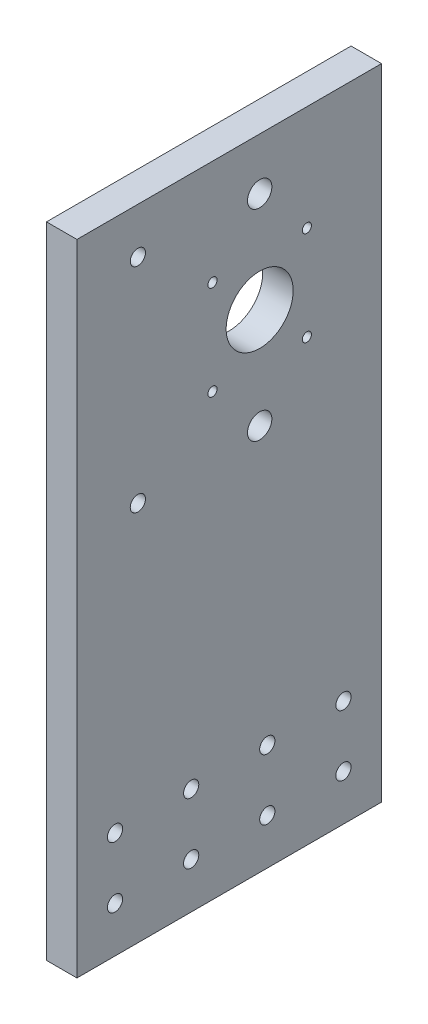
ISO-10303-21;
HEADER;
FILE_DESCRIPTION(('STEP AP214'),'2;1');
FILE_NAME('part.step','',(''),(''),'','','');
FILE_SCHEMA(('AUTOMOTIVE_DESIGN { 1 0 10303 214 1 1 1 1 }'));
ENDSEC;
DATA;
#1=APPLICATION_CONTEXT('core data for automotive mechanical design processes');
#2=APPLICATION_PROTOCOL_DEFINITION('international standard','automotive_design',2000,#1);
#3=PRODUCT_CONTEXT('',#1,'mechanical');
#4=PRODUCT('Part','Part','',(#3));
#5=PRODUCT_RELATED_PRODUCT_CATEGORY('part','',(#4));
#6=PRODUCT_DEFINITION_FORMATION('','',#4);
#7=PRODUCT_DEFINITION_CONTEXT('part definition',#1,'design');
#8=PRODUCT_DEFINITION('design','',#6,#7);
#9=PRODUCT_DEFINITION_SHAPE('','',#8);
#10=(LENGTH_UNIT() NAMED_UNIT(*) SI_UNIT(.MILLI.,.METRE.));
#11=(NAMED_UNIT(*) PLANE_ANGLE_UNIT() SI_UNIT($,.RADIAN.));
#12=(NAMED_UNIT(*) SI_UNIT($,.STERADIAN.) SOLID_ANGLE_UNIT());
#13=UNCERTAINTY_MEASURE_WITH_UNIT(LENGTH_MEASURE(1.E-05),#10,'distance_accuracy_value','');
#14=(GEOMETRIC_REPRESENTATION_CONTEXT(3) GLOBAL_UNCERTAINTY_ASSIGNED_CONTEXT((#13)) GLOBAL_UNIT_ASSIGNED_CONTEXT((#10,
#11,#12)) REPRESENTATION_CONTEXT('',''));
#15=CARTESIAN_POINT('',(0.,0.,0.));
#16=DIRECTION('',(0.,0.,1.));
#17=DIRECTION('',(1.,0.,0.));
#18=AXIS2_PLACEMENT_3D('',#15,#16,#17);
#19=CARTESIAN_POINT('',(0.,70.5,-15.5));
#20=DIRECTION('',(1.,0.,0.));
#21=DIRECTION('',(0.,0.,-1.));
#22=AXIS2_PLACEMENT_3D('',#19,#20,#21);
#23=CYLINDRICAL_SURFACE('',#22,1.5);
#24=CARTESIAN_POINT('',(10.,70.5,-15.5));
#25=DIRECTION('',(1.,0.,0.));
#26=DIRECTION('',(0.,0.,1.));
#27=AXIS2_PLACEMENT_3D('',#24,#25,#26);
#28=CIRCLE('',#27,1.5);
#29=CARTESIAN_POINT('',(10.,70.5,-14.));
#30=VERTEX_POINT('',#29);
#31=EDGE_CURVE('E131',#30,#30,#28,.T.);
#32=ORIENTED_EDGE('',*,*,#31,.T.);
#33=EDGE_LOOP('',(#32));
#34=FACE_BOUND('',#33,.T.);
#35=CARTESIAN_POINT('',(3.,70.5,-15.5));
#36=DIRECTION('',(-1.,0.,0.));
#37=DIRECTION('',(0.,0.,1.));
#38=AXIS2_PLACEMENT_3D('',#35,#36,#37);
#39=CIRCLE('',#38,1.5);
#40=CARTESIAN_POINT('',(3.,70.5,-14.));
#41=VERTEX_POINT('',#40);
#42=EDGE_CURVE('E117',#41,#41,#39,.F.);
#43=ORIENTED_EDGE('',*,*,#42,.F.);
#44=EDGE_LOOP('',(#43));
#45=FACE_BOUND('',#44,.T.);
#46=ADVANCED_FACE('F34',(#34,#45),#23,.F.);
#47=CARTESIAN_POINT('',(0.,39.5,15.5));
#48=DIRECTION('',(1.,0.,0.));
#49=DIRECTION('',(0.,0.,-1.));
#50=AXIS2_PLACEMENT_3D('',#47,#48,#49);
#51=CYLINDRICAL_SURFACE('',#50,1.5);
#52=CARTESIAN_POINT('',(10.,39.5,15.5));
#53=DIRECTION('',(1.,0.,0.));
#54=DIRECTION('',(0.,0.,1.));
#55=AXIS2_PLACEMENT_3D('',#52,#53,#54);
#56=CIRCLE('',#55,1.5);
#57=CARTESIAN_POINT('',(10.,39.5,17.));
#58=VERTEX_POINT('',#57);
#59=EDGE_CURVE('E126',#58,#58,#56,.T.);
#60=ORIENTED_EDGE('',*,*,#59,.T.);
#61=EDGE_LOOP('',(#60));
#62=FACE_BOUND('',#61,.T.);
#63=CARTESIAN_POINT('',(3.,39.5,15.5));
#64=DIRECTION('',(-1.,0.,0.));
#65=DIRECTION('',(0.,0.,1.));
#66=AXIS2_PLACEMENT_3D('',#63,#64,#65);
#67=CIRCLE('',#66,1.5);
#68=CARTESIAN_POINT('',(3.,39.5,17.));
#69=VERTEX_POINT('',#68);
#70=EDGE_CURVE('E114',#69,#69,#67,.F.);
#71=ORIENTED_EDGE('',*,*,#70,.F.);
#72=EDGE_LOOP('',(#71));
#73=FACE_BOUND('',#72,.T.);
#74=ADVANCED_FACE('F233',(#62,#73),#51,.F.);
#75=CARTESIAN_POINT('',(10.,0.,0.));
#76=DIRECTION('',(1.,0.,0.));
#77=DIRECTION('',(0.,0.,-1.));
#78=AXIS2_PLACEMENT_3D('',#75,#76,#77);
#79=PLANE('',#78);
#80=CARTESIAN_POINT('',(10.,39.4999999999999,-15.5));
#81=DIRECTION('',(1.,0.,0.));
#82=DIRECTION('',(0.,0.,-1.));
#83=AXIS2_PLACEMENT_3D('',#80,#81,#82);
#84=CIRCLE('',#83,1.5);
#85=CARTESIAN_POINT('',(10.,39.4999999999999,-17.));
#86=VERTEX_POINT('',#85);
#87=EDGE_CURVE('E122',#86,#86,#84,.T.);
#88=ORIENTED_EDGE('',*,*,#87,.F.);
#89=EDGE_LOOP('',(#88));
#90=FACE_BOUND('',#89,.T.);
#91=ORIENTED_EDGE('',*,*,#59,.F.);
#92=EDGE_LOOP('',(#91));
#93=FACE_BOUND('',#92,.T.);
#94=ORIENTED_EDGE('',*,*,#31,.F.);
#95=EDGE_LOOP('',(#94));
#96=FACE_BOUND('',#95,.T.);
#97=CARTESIAN_POINT('',(10.,70.5,15.5));
#98=DIRECTION('',(1.,0.,0.));
#99=DIRECTION('',(0.,0.,-1.));
#100=AXIS2_PLACEMENT_3D('',#97,#98,#99);
#101=CIRCLE('',#100,1.5);
#102=CARTESIAN_POINT('',(10.,70.5,14.));
#103=VERTEX_POINT('',#102);
#104=EDGE_CURVE('E142',#103,#103,#101,.T.);
#105=ORIENTED_EDGE('',*,*,#104,.F.);
#106=EDGE_LOOP('',(#105));
#107=FACE_BOUND('',#106,.T.);
#108=CARTESIAN_POINT('',(10.,55.,0.));
#109=DIRECTION('',(1.,0.,0.));
#110=DIRECTION('',(0.,0.,-1.));
#111=AXIS2_PLACEMENT_3D('',#108,#109,#110);
#112=CIRCLE('',#111,11.);
#113=CARTESIAN_POINT('',(10.,55.,-11.));
#114=VERTEX_POINT('',#113);
#115=EDGE_CURVE('E139',#114,#114,#112,.T.);
#116=ORIENTED_EDGE('',*,*,#115,.F.);
#117=EDGE_LOOP('',(#116));
#118=FACE_BOUND('',#117,.T.);
#119=CARTESIAN_POINT('',(10.,90.,40.));
#120=DIRECTION('',(1.,0.,0.));
#121=DIRECTION('',(0.,0.,-1.));
#122=AXIS2_PLACEMENT_3D('',#119,#120,#121);
#123=CIRCLE('',#122,2.5);
#124=CARTESIAN_POINT('',(10.,90.,37.5));
#125=VERTEX_POINT('',#124);
#126=EDGE_CURVE('E147',#125,#125,#123,.T.);
#127=ORIENTED_EDGE('',*,*,#126,.F.);
#128=EDGE_LOOP('',(#127));
#129=FACE_BOUND('',#128,.T.);
#130=CARTESIAN_POINT('',(10.,19.9999999999999,40.));
#131=DIRECTION('',(1.,0.,0.));
#132=DIRECTION('',(0.,0.,1.));
#133=AXIS2_PLACEMENT_3D('',#130,#131,#132);
#134=CIRCLE('',#133,2.5);
#135=CARTESIAN_POINT('',(10.,19.9999999999999,42.5));
#136=VERTEX_POINT('',#135);
#137=EDGE_CURVE('E138',#136,#136,#134,.T.);
#138=ORIENTED_EDGE('',*,*,#137,.F.);
#139=EDGE_LOOP('',(#138));
#140=FACE_BOUND('',#139,.T.);
#141=CARTESIAN_POINT('',(10.,-70.,47.5));
#142=DIRECTION('',(1.,0.,0.));
#143=DIRECTION('',(0.,0.,1.));
#144=AXIS2_PLACEMENT_3D('',#141,#142,#143);
#145=CIRCLE('',#144,2.5);
#146=CARTESIAN_POINT('',(10.,-70.,50.));
#147=VERTEX_POINT('',#146);
#148=EDGE_CURVE('E177',#147,#147,#145,.T.);
#149=ORIENTED_EDGE('',*,*,#148,.F.);
#150=EDGE_LOOP('',(#149));
#151=FACE_BOUND('',#150,.T.);
#152=CARTESIAN_POINT('',(10.,-90.,47.5));
#153=DIRECTION('',(1.,0.,0.));
#154=DIRECTION('',(0.,0.,-1.));
#155=AXIS2_PLACEMENT_3D('',#152,#153,#154);
#156=CIRCLE('',#155,2.5);
#157=CARTESIAN_POINT('',(10.,-90.,45.));
#158=VERTEX_POINT('',#157);
#159=EDGE_CURVE('E183',#158,#158,#156,.T.);
#160=ORIENTED_EDGE('',*,*,#159,.F.);
#161=EDGE_LOOP('',(#160));
#162=FACE_BOUND('',#161,.T.);
#163=CARTESIAN_POINT('',(10.,-90.,22.5));
#164=DIRECTION('',(1.,0.,0.));
#165=DIRECTION('',(0.,0.,1.));
#166=AXIS2_PLACEMENT_3D('',#163,#164,#165);
#167=CIRCLE('',#166,2.5);
#168=CARTESIAN_POINT('',(10.,-90.,25.));
#169=VERTEX_POINT('',#168);
#170=EDGE_CURVE('E189',#169,#169,#167,.T.);
#171=ORIENTED_EDGE('',*,*,#170,.F.);
#172=EDGE_LOOP('',(#171));
#173=FACE_BOUND('',#172,.T.);
#174=CARTESIAN_POINT('',(10.,-90.,-2.5));
#175=DIRECTION('',(1.,0.,0.));
#176=DIRECTION('',(0.,0.,-1.));
#177=AXIS2_PLACEMENT_3D('',#174,#175,#176);
#178=CIRCLE('',#177,2.5);
#179=CARTESIAN_POINT('',(10.,-90.,-4.99999999999999));
#180=VERTEX_POINT('',#179);
#181=EDGE_CURVE('E158',#180,#180,#178,.T.);
#182=ORIENTED_EDGE('',*,*,#181,.F.);
#183=EDGE_LOOP('',(#182));
#184=FACE_BOUND('',#183,.T.);
#185=CARTESIAN_POINT('',(10.,-90.,-27.5));
#186=DIRECTION('',(1.,0.,0.));
#187=DIRECTION('',(0.,0.,1.));
#188=AXIS2_PLACEMENT_3D('',#185,#186,#187);
#189=CIRCLE('',#188,2.5);
#190=CARTESIAN_POINT('',(10.,-90.,-25.));
#191=VERTEX_POINT('',#190);
#192=EDGE_CURVE('E159',#191,#191,#189,.T.);
#193=ORIENTED_EDGE('',*,*,#192,.F.);
#194=EDGE_LOOP('',(#193));
#195=FACE_BOUND('',#194,.T.);
#196=CARTESIAN_POINT('',(10.,-70.,-27.5));
#197=DIRECTION('',(1.,0.,0.));
#198=DIRECTION('',(0.,0.,-1.));
#199=AXIS2_PLACEMENT_3D('',#196,#197,#198);
#200=CIRCLE('',#199,2.5);
#201=CARTESIAN_POINT('',(10.,-70.,-30.));
#202=VERTEX_POINT('',#201);
#203=EDGE_CURVE('E165',#202,#202,#200,.T.);
#204=ORIENTED_EDGE('',*,*,#203,.F.);
#205=EDGE_LOOP('',(#204));
#206=FACE_BOUND('',#205,.T.);
#207=CARTESIAN_POINT('',(10.,-70.,-2.5));
#208=DIRECTION('',(1.,0.,0.));
#209=DIRECTION('',(0.,0.,1.));
#210=AXIS2_PLACEMENT_3D('',#207,#208,#209);
#211=CIRCLE('',#210,2.5);
#212=CARTESIAN_POINT('',(10.,-70.,0.));
#213=VERTEX_POINT('',#212);
#214=EDGE_CURVE('E146',#213,#213,#211,.T.);
#215=ORIENTED_EDGE('',*,*,#214,.F.);
#216=EDGE_LOOP('',(#215));
#217=FACE_BOUND('',#216,.T.);
#218=CARTESIAN_POINT('',(10.,-70.,22.5));
#219=DIRECTION('',(1.,0.,0.));
#220=DIRECTION('',(0.,0.,-1.));
#221=AXIS2_PLACEMENT_3D('',#218,#219,#220);
#222=CIRCLE('',#221,2.5);
#223=CARTESIAN_POINT('',(10.,-70.,20.));
#224=VERTEX_POINT('',#223);
#225=EDGE_CURVE('E176',#224,#224,#222,.T.);
#226=ORIENTED_EDGE('',*,*,#225,.F.);
#227=EDGE_LOOP('',(#226));
#228=FACE_BOUND('',#227,.T.);
#229=CARTESIAN_POINT('',(10.,88.,0.));
#230=DIRECTION('',(1.,0.,0.));
#231=DIRECTION('',(0.,0.,-1.));
#232=AXIS2_PLACEMENT_3D('',#229,#230,#231);
#233=CIRCLE('',#232,4.00000000000001);
#234=CARTESIAN_POINT('',(10.,88.,-4.00000000000001));
#235=VERTEX_POINT('',#234);
#236=EDGE_CURVE('E105',#235,#235,#233,.T.);
#237=ORIENTED_EDGE('',*,*,#236,.F.);
#238=EDGE_LOOP('',(#237));
#239=FACE_BOUND('',#238,.T.);
#240=DIRECTION('',(0.,-1.,0.));
#241=VECTOR('',#240,1.);
#242=CARTESIAN_POINT('',(10.,-105.,60.));
#243=LINE('',#242,#241);
#244=CARTESIAN_POINT('',(10.,105.,60.));
#245=VERTEX_POINT('',#244);
#246=CARTESIAN_POINT('',(10.,-105.,60.));
#247=VERTEX_POINT('',#246);
#248=EDGE_CURVE('E89',#245,#247,#243,.T.);
#249=ORIENTED_EDGE('',*,*,#248,.T.);
#250=DIRECTION('',(0.,0.,-1.));
#251=VECTOR('',#250,1.);
#252=CARTESIAN_POINT('',(10.,-105.,-40.));
#253=LINE('',#252,#251);
#254=CARTESIAN_POINT('',(10.,-105.,-40.));
#255=VERTEX_POINT('',#254);
#256=EDGE_CURVE('E83',#247,#255,#253,.T.);
#257=ORIENTED_EDGE('',*,*,#256,.T.);
#258=DIRECTION('',(0.,1.,0.));
#259=VECTOR('',#258,1.);
#260=CARTESIAN_POINT('',(10.,-105.,-40.));
#261=LINE('',#260,#259);
#262=CARTESIAN_POINT('',(10.,105.,-40.));
#263=VERTEX_POINT('',#262);
#264=EDGE_CURVE('E87',#255,#263,#261,.T.);
#265=ORIENTED_EDGE('',*,*,#264,.T.);
#266=DIRECTION('',(0.,0.,1.));
#267=VECTOR('',#266,1.);
#268=CARTESIAN_POINT('',(10.,105.,-40.));
#269=LINE('',#268,#267);
#270=EDGE_CURVE('E53',#263,#245,#269,.T.);
#271=ORIENTED_EDGE('',*,*,#270,.T.);
#272=EDGE_LOOP('',(#249,#257,#265,#271));
#273=FACE_BOUND('',#272,.T.);
#274=CARTESIAN_POINT('',(10.,22.,0.));
#275=DIRECTION('',(1.,0.,0.));
#276=DIRECTION('',(0.,0.,1.));
#277=AXIS2_PLACEMENT_3D('',#274,#275,#276);
#278=CIRCLE('',#277,4.);
#279=CARTESIAN_POINT('',(10.,22.,4.));
#280=VERTEX_POINT('',#279);
#281=EDGE_CURVE('E203',#280,#280,#278,.T.);
#282=ORIENTED_EDGE('',*,*,#281,.F.);
#283=EDGE_LOOP('',(#282));
#284=FACE_BOUND('',#283,.T.);
#285=ADVANCED_FACE('F84',(#90,#93,#96,#107,#118,#129,#140,#151,#162,#173,#184,#195,#206,#217,
#228,#239,#273,#284),#79,.T.);
#286=CARTESIAN_POINT('',(0.,0.,0.));
#287=DIRECTION('',(1.,0.,0.));
#288=DIRECTION('',(0.,0.,-1.));
#289=AXIS2_PLACEMENT_3D('',#286,#287,#288);
#290=PLANE('',#289);
#291=CARTESIAN_POINT('',(0.,39.4999999999999,-15.5));
#292=DIRECTION('',(-1.,0.,0.));
#293=DIRECTION('',(0.,0.,-1.));
#294=AXIS2_PLACEMENT_3D('',#291,#292,#293);
#295=CIRCLE('',#294,2.75);
#296=CARTESIAN_POINT('',(0.,39.4999999999999,-18.25));
#297=VERTEX_POINT('',#296);
#298=EDGE_CURVE('E447',#297,#297,#295,.T.);
#299=ORIENTED_EDGE('',*,*,#298,.F.);
#300=EDGE_LOOP('',(#299));
#301=FACE_BOUND('',#300,.T.);
#302=CARTESIAN_POINT('',(0.,39.4999999999999,15.5));
#303=DIRECTION('',(-1.,0.,0.));
#304=DIRECTION('',(0.,0.,1.));
#305=AXIS2_PLACEMENT_3D('',#302,#303,#304);
#306=CIRCLE('',#305,2.75);
#307=CARTESIAN_POINT('',(0.,39.4999999999999,18.25));
#308=VERTEX_POINT('',#307);
#309=EDGE_CURVE('E439',#308,#308,#306,.T.);
#310=ORIENTED_EDGE('',*,*,#309,.F.);
#311=EDGE_LOOP('',(#310));
#312=FACE_BOUND('',#311,.T.);
#313=CARTESIAN_POINT('',(0.,70.5,15.5));
#314=DIRECTION('',(-1.,0.,0.));
#315=DIRECTION('',(0.,0.,-1.));
#316=AXIS2_PLACEMENT_3D('',#313,#314,#315);
#317=CIRCLE('',#316,2.75);
#318=CARTESIAN_POINT('',(0.,70.5,12.75));
#319=VERTEX_POINT('',#318);
#320=EDGE_CURVE('E432',#319,#319,#317,.T.);
#321=ORIENTED_EDGE('',*,*,#320,.F.);
#322=EDGE_LOOP('',(#321));
#323=FACE_BOUND('',#322,.T.);
#324=CARTESIAN_POINT('',(0.,70.5,-15.5));
#325=DIRECTION('',(-1.,0.,0.));
#326=DIRECTION('',(0.,0.,1.));
#327=AXIS2_PLACEMENT_3D('',#324,#325,#326);
#328=CIRCLE('',#327,2.75);
#329=CARTESIAN_POINT('',(0.,70.5,-12.75));
#330=VERTEX_POINT('',#329);
#331=EDGE_CURVE('E436',#330,#330,#328,.T.);
#332=ORIENTED_EDGE('',*,*,#331,.F.);
#333=EDGE_LOOP('',(#332));
#334=FACE_BOUND('',#333,.T.);
#335=CARTESIAN_POINT('',(0.,55.,0.));
#336=DIRECTION('',(1.,0.,0.));
#337=DIRECTION('',(0.,0.,-1.));
#338=AXIS2_PLACEMENT_3D('',#335,#336,#337);
#339=CIRCLE('',#338,11.);
#340=CARTESIAN_POINT('',(0.,55.,-11.));
#341=VERTEX_POINT('',#340);
#342=EDGE_CURVE('E135',#341,#341,#339,.T.);
#343=ORIENTED_EDGE('',*,*,#342,.T.);
#344=EDGE_LOOP('',(#343));
#345=FACE_BOUND('',#344,.T.);
#346=CARTESIAN_POINT('',(0.,90.,40.));
#347=DIRECTION('',(1.,0.,0.));
#348=DIRECTION('',(0.,0.,-1.));
#349=AXIS2_PLACEMENT_3D('',#346,#347,#348);
#350=CIRCLE('',#349,2.5);
#351=CARTESIAN_POINT('',(0.,90.,37.5));
#352=VERTEX_POINT('',#351);
#353=EDGE_CURVE('E143',#352,#352,#350,.T.);
#354=ORIENTED_EDGE('',*,*,#353,.T.);
#355=EDGE_LOOP('',(#354));
#356=FACE_BOUND('',#355,.T.);
#357=CARTESIAN_POINT('',(0.,19.9999999999999,40.));
#358=DIRECTION('',(1.,0.,0.));
#359=DIRECTION('',(0.,0.,1.));
#360=AXIS2_PLACEMENT_3D('',#357,#358,#359);
#361=CIRCLE('',#360,2.5);
#362=CARTESIAN_POINT('',(0.,19.9999999999999,42.5));
#363=VERTEX_POINT('',#362);
#364=EDGE_CURVE('E150',#363,#363,#361,.T.);
#365=ORIENTED_EDGE('',*,*,#364,.T.);
#366=EDGE_LOOP('',(#365));
#367=FACE_BOUND('',#366,.T.);
#368=CARTESIAN_POINT('',(0.,-70.,47.5));
#369=DIRECTION('',(1.,0.,0.));
#370=DIRECTION('',(0.,0.,1.));
#371=AXIS2_PLACEMENT_3D('',#368,#369,#370);
#372=CIRCLE('',#371,2.5);
#373=CARTESIAN_POINT('',(0.,-70.,50.));
#374=VERTEX_POINT('',#373);
#375=EDGE_CURVE('E173',#374,#374,#372,.T.);
#376=ORIENTED_EDGE('',*,*,#375,.T.);
#377=EDGE_LOOP('',(#376));
#378=FACE_BOUND('',#377,.T.);
#379=CARTESIAN_POINT('',(0.,-90.,47.5));
#380=DIRECTION('',(1.,0.,0.));
#381=DIRECTION('',(0.,0.,-1.));
#382=AXIS2_PLACEMENT_3D('',#379,#380,#381);
#383=CIRCLE('',#382,2.5);
#384=CARTESIAN_POINT('',(0.,-90.,45.));
#385=VERTEX_POINT('',#384);
#386=EDGE_CURVE('E180',#385,#385,#383,.T.);
#387=ORIENTED_EDGE('',*,*,#386,.T.);
#388=EDGE_LOOP('',(#387));
#389=FACE_BOUND('',#388,.T.);
#390=CARTESIAN_POINT('',(0.,-90.,22.5));
#391=DIRECTION('',(1.,0.,0.));
#392=DIRECTION('',(0.,0.,1.));
#393=AXIS2_PLACEMENT_3D('',#390,#391,#392);
#394=CIRCLE('',#393,2.5);
#395=CARTESIAN_POINT('',(0.,-90.,25.));
#396=VERTEX_POINT('',#395);
#397=EDGE_CURVE('E186',#396,#396,#394,.T.);
#398=ORIENTED_EDGE('',*,*,#397,.T.);
#399=EDGE_LOOP('',(#398));
#400=FACE_BOUND('',#399,.T.);
#401=CARTESIAN_POINT('',(0.,-90.,-2.5));
#402=DIRECTION('',(1.,0.,0.));
#403=DIRECTION('',(0.,0.,-1.));
#404=AXIS2_PLACEMENT_3D('',#401,#402,#403);
#405=CIRCLE('',#404,2.5);
#406=CARTESIAN_POINT('',(0.,-90.,-4.99999999999999));
#407=VERTEX_POINT('',#406);
#408=EDGE_CURVE('E192',#407,#407,#405,.T.);
#409=ORIENTED_EDGE('',*,*,#408,.T.);
#410=EDGE_LOOP('',(#409));
#411=FACE_BOUND('',#410,.T.);
#412=CARTESIAN_POINT('',(0.,-90.,-27.5));
#413=DIRECTION('',(1.,0.,0.));
#414=DIRECTION('',(0.,0.,1.));
#415=AXIS2_PLACEMENT_3D('',#412,#413,#414);
#416=CIRCLE('',#415,2.5);
#417=CARTESIAN_POINT('',(0.,-90.,-25.));
#418=VERTEX_POINT('',#417);
#419=EDGE_CURVE('E155',#418,#418,#416,.T.);
#420=ORIENTED_EDGE('',*,*,#419,.T.);
#421=EDGE_LOOP('',(#420));
#422=FACE_BOUND('',#421,.T.);
#423=CARTESIAN_POINT('',(0.,-70.,-27.5));
#424=DIRECTION('',(1.,0.,0.));
#425=DIRECTION('',(0.,0.,-1.));
#426=AXIS2_PLACEMENT_3D('',#423,#424,#425);
#427=CIRCLE('',#426,2.5);
#428=CARTESIAN_POINT('',(0.,-70.,-30.));
#429=VERTEX_POINT('',#428);
#430=EDGE_CURVE('E162',#429,#429,#427,.T.);
#431=ORIENTED_EDGE('',*,*,#430,.T.);
#432=EDGE_LOOP('',(#431));
#433=FACE_BOUND('',#432,.T.);
#434=CARTESIAN_POINT('',(0.,-70.,-2.5));
#435=DIRECTION('',(1.,0.,0.));
#436=DIRECTION('',(0.,0.,1.));
#437=AXIS2_PLACEMENT_3D('',#434,#435,#436);
#438=CIRCLE('',#437,2.5);
#439=CARTESIAN_POINT('',(0.,-70.,0.));
#440=VERTEX_POINT('',#439);
#441=EDGE_CURVE('E168',#440,#440,#438,.T.);
#442=ORIENTED_EDGE('',*,*,#441,.T.);
#443=EDGE_LOOP('',(#442));
#444=FACE_BOUND('',#443,.T.);
#445=CARTESIAN_POINT('',(0.,-70.,22.5));
#446=DIRECTION('',(1.,0.,0.));
#447=DIRECTION('',(0.,0.,-1.));
#448=AXIS2_PLACEMENT_3D('',#445,#446,#447);
#449=CIRCLE('',#448,2.5);
#450=CARTESIAN_POINT('',(0.,-70.,20.));
#451=VERTEX_POINT('',#450);
#452=EDGE_CURVE('E197',#451,#451,#449,.T.);
#453=ORIENTED_EDGE('',*,*,#452,.T.);
#454=EDGE_LOOP('',(#453));
#455=FACE_BOUND('',#454,.T.);
#456=DIRECTION('',(0.,-1.,0.));
#457=VECTOR('',#456,1.);
#458=CARTESIAN_POINT('',(0.,-105.,60.));
#459=LINE('',#458,#457);
#460=CARTESIAN_POINT('',(0.,105.,60.));
#461=VERTEX_POINT('',#460);
#462=CARTESIAN_POINT('',(0.,-105.,60.));
#463=VERTEX_POINT('',#462);
#464=EDGE_CURVE('E102',#461,#463,#459,.T.);
#465=ORIENTED_EDGE('',*,*,#464,.F.);
#466=DIRECTION('',(0.,0.,1.));
#467=VECTOR('',#466,1.);
#468=CARTESIAN_POINT('',(0.,105.,-40.));
#469=LINE('',#468,#467);
#470=CARTESIAN_POINT('',(0.,105.,-40.));
#471=VERTEX_POINT('',#470);
#472=EDGE_CURVE('E76',#471,#461,#469,.T.);
#473=ORIENTED_EDGE('',*,*,#472,.F.);
#474=DIRECTION('',(0.,1.,0.));
#475=VECTOR('',#474,1.);
#476=CARTESIAN_POINT('',(0.,-105.,-40.));
#477=LINE('',#476,#475);
#478=CARTESIAN_POINT('',(0.,-105.,-40.));
#479=VERTEX_POINT('',#478);
#480=EDGE_CURVE('E70',#479,#471,#477,.T.);
#481=ORIENTED_EDGE('',*,*,#480,.F.);
#482=DIRECTION('',(0.,0.,-1.));
#483=VECTOR('',#482,1.);
#484=CARTESIAN_POINT('',(0.,-105.,-40.));
#485=LINE('',#484,#483);
#486=EDGE_CURVE('E93',#463,#479,#485,.T.);
#487=ORIENTED_EDGE('',*,*,#486,.F.);
#488=EDGE_LOOP('',(#465,#473,#481,#487));
#489=FACE_BOUND('',#488,.T.);
#490=CARTESIAN_POINT('',(0.,88.,0.));
#491=DIRECTION('',(1.,0.,0.));
#492=DIRECTION('',(0.,0.,-1.));
#493=AXIS2_PLACEMENT_3D('',#490,#491,#492);
#494=CIRCLE('',#493,4.00000000000001);
#495=CARTESIAN_POINT('',(0.,88.,-4.00000000000001));
#496=VERTEX_POINT('',#495);
#497=EDGE_CURVE('E206',#496,#496,#494,.T.);
#498=ORIENTED_EDGE('',*,*,#497,.T.);
#499=EDGE_LOOP('',(#498));
#500=FACE_BOUND('',#499,.T.);
#501=CARTESIAN_POINT('',(0.,22.,0.));
#502=DIRECTION('',(1.,0.,0.));
#503=DIRECTION('',(0.,0.,1.));
#504=AXIS2_PLACEMENT_3D('',#501,#502,#503);
#505=CIRCLE('',#504,4.);
#506=CARTESIAN_POINT('',(0.,22.,4.));
#507=VERTEX_POINT('',#506);
#508=EDGE_CURVE('E200',#507,#507,#505,.T.);
#509=ORIENTED_EDGE('',*,*,#508,.T.);
#510=EDGE_LOOP('',(#509));
#511=FACE_BOUND('',#510,.T.);
#512=ADVANCED_FACE('F214',(#301,#312,#323,#334,#345,#356,#367,#378,#389,#400,#411,#422,#433,
#444,#455,#489,#500,#511),#290,.F.);
#513=CARTESIAN_POINT('',(10.,-105.,60.));
#514=DIRECTION('',(0.,0.,-1.));
#515=DIRECTION('',(-1.,0.,0.));
#516=AXIS2_PLACEMENT_3D('',#513,#514,#515);
#517=PLANE('',#516);
#518=ORIENTED_EDGE('',*,*,#464,.T.);
#519=DIRECTION('',(-1.,0.,0.));
#520=VECTOR('',#519,1.);
#521=CARTESIAN_POINT('',(10.,-105.,60.));
#522=LINE('',#521,#520);
#523=EDGE_CURVE('E11',#247,#463,#522,.T.);
#524=ORIENTED_EDGE('',*,*,#523,.F.);
#525=ORIENTED_EDGE('',*,*,#248,.F.);
#526=DIRECTION('',(-1.,0.,0.));
#527=VECTOR('',#526,1.);
#528=CARTESIAN_POINT('',(10.,105.,60.));
#529=LINE('',#528,#527);
#530=EDGE_CURVE('E98',#245,#461,#529,.T.);
#531=ORIENTED_EDGE('',*,*,#530,.T.);
#532=EDGE_LOOP('',(#518,#524,#525,#531));
#533=FACE_BOUND('',#532,.T.);
#534=ADVANCED_FACE('F36',(#533),#517,.F.);
#535=CARTESIAN_POINT('',(10.,-105.,-40.));
#536=DIRECTION('',(0.,1.,0.));
#537=DIRECTION('',(0.,0.,1.));
#538=AXIS2_PLACEMENT_3D('',#535,#536,#537);
#539=PLANE('',#538);
#540=ORIENTED_EDGE('',*,*,#486,.T.);
#541=DIRECTION('',(-1.,0.,0.));
#542=VECTOR('',#541,1.);
#543=CARTESIAN_POINT('',(10.,-105.,-40.));
#544=LINE('',#543,#542);
#545=EDGE_CURVE('E44',#255,#479,#544,.T.);
#546=ORIENTED_EDGE('',*,*,#545,.F.);
#547=ORIENTED_EDGE('',*,*,#256,.F.);
#548=ORIENTED_EDGE('',*,*,#523,.T.);
#549=EDGE_LOOP('',(#540,#546,#547,#548));
#550=FACE_BOUND('',#549,.T.);
#551=ADVANCED_FACE('F92',(#550),#539,.F.);
#552=CARTESIAN_POINT('',(10.,-105.,-40.));
#553=DIRECTION('',(0.,0.,1.));
#554=DIRECTION('',(1.,0.,0.));
#555=AXIS2_PLACEMENT_3D('',#552,#553,#554);
#556=PLANE('',#555);
#557=ORIENTED_EDGE('',*,*,#480,.T.);
#558=DIRECTION('',(-1.,0.,0.));
#559=VECTOR('',#558,1.);
#560=CARTESIAN_POINT('',(10.,105.,-40.));
#561=LINE('',#560,#559);
#562=EDGE_CURVE('E94',#263,#471,#561,.T.);
#563=ORIENTED_EDGE('',*,*,#562,.F.);
#564=ORIENTED_EDGE('',*,*,#264,.F.);
#565=ORIENTED_EDGE('',*,*,#545,.T.);
#566=EDGE_LOOP('',(#557,#563,#564,#565));
#567=FACE_BOUND('',#566,.T.);
#568=ADVANCED_FACE('F96',(#567),#556,.F.);
#569=CARTESIAN_POINT('',(10.,105.,-40.));
#570=DIRECTION('',(0.,-1.,0.));
#571=DIRECTION('',(0.,0.,-1.));
#572=AXIS2_PLACEMENT_3D('',#569,#570,#571);
#573=PLANE('',#572);
#574=ORIENTED_EDGE('',*,*,#472,.T.);
#575=ORIENTED_EDGE('',*,*,#530,.F.);
#576=ORIENTED_EDGE('',*,*,#270,.F.);
#577=ORIENTED_EDGE('',*,*,#562,.T.);
#578=EDGE_LOOP('',(#574,#575,#576,#577));
#579=FACE_BOUND('',#578,.T.);
#580=ADVANCED_FACE('F220',(#579),#573,.F.);
#581=CARTESIAN_POINT('',(10.,88.,0.));
#582=DIRECTION('',(-1.,0.,0.));
#583=DIRECTION('',(0.,0.,1.));
#584=AXIS2_PLACEMENT_3D('',#581,#582,#583);
#585=CYLINDRICAL_SURFACE('',#584,4.00000000000001);
#586=ORIENTED_EDGE('',*,*,#236,.T.);
#587=EDGE_LOOP('',(#586));
#588=FACE_BOUND('',#587,.T.);
#589=ORIENTED_EDGE('',*,*,#497,.F.);
#590=EDGE_LOOP('',(#589));
#591=FACE_BOUND('',#590,.T.);
#592=ADVANCED_FACE('F217',(#588,#591),#585,.F.);
#593=CARTESIAN_POINT('',(10.,22.,0.));
#594=DIRECTION('',(-1.,0.,0.));
#595=DIRECTION('',(0.,0.,1.));
#596=AXIS2_PLACEMENT_3D('',#593,#594,#595);
#597=CYLINDRICAL_SURFACE('',#596,4.);
#598=ORIENTED_EDGE('',*,*,#281,.T.);
#599=EDGE_LOOP('',(#598));
#600=FACE_BOUND('',#599,.T.);
#601=ORIENTED_EDGE('',*,*,#508,.F.);
#602=EDGE_LOOP('',(#601));
#603=FACE_BOUND('',#602,.T.);
#604=ADVANCED_FACE('F219',(#600,#603),#597,.F.);
#605=CARTESIAN_POINT('',(0.,-70.,22.5));
#606=DIRECTION('',(1.,0.,0.));
#607=DIRECTION('',(0.,0.,-1.));
#608=AXIS2_PLACEMENT_3D('',#605,#606,#607);
#609=CYLINDRICAL_SURFACE('',#608,2.5);
#610=ORIENTED_EDGE('',*,*,#452,.F.);
#611=EDGE_LOOP('',(#610));
#612=FACE_BOUND('',#611,.T.);
#613=ORIENTED_EDGE('',*,*,#225,.T.);
#614=EDGE_LOOP('',(#613));
#615=FACE_BOUND('',#614,.T.);
#616=ADVANCED_FACE('F227',(#612,#615),#609,.F.);
#617=CARTESIAN_POINT('',(0.,-70.,-2.5));
#618=DIRECTION('',(1.,0.,0.));
#619=DIRECTION('',(0.,0.,-1.));
#620=AXIS2_PLACEMENT_3D('',#617,#618,#619);
#621=CYLINDRICAL_SURFACE('',#620,2.5);
#622=ORIENTED_EDGE('',*,*,#441,.F.);
#623=EDGE_LOOP('',(#622));
#624=FACE_BOUND('',#623,.T.);
#625=ORIENTED_EDGE('',*,*,#214,.T.);
#626=EDGE_LOOP('',(#625));
#627=FACE_BOUND('',#626,.T.);
#628=ADVANCED_FACE('F273',(#624,#627),#621,.F.);
#629=CARTESIAN_POINT('',(0.,-70.,-27.5));
#630=DIRECTION('',(1.,0.,0.));
#631=DIRECTION('',(0.,0.,-1.));
#632=AXIS2_PLACEMENT_3D('',#629,#630,#631);
#633=CYLINDRICAL_SURFACE('',#632,2.5);
#634=ORIENTED_EDGE('',*,*,#430,.F.);
#635=EDGE_LOOP('',(#634));
#636=FACE_BOUND('',#635,.T.);
#637=ORIENTED_EDGE('',*,*,#203,.T.);
#638=EDGE_LOOP('',(#637));
#639=FACE_BOUND('',#638,.T.);
#640=ADVANCED_FACE('F269',(#636,#639),#633,.F.);
#641=CARTESIAN_POINT('',(0.,-90.,-27.5));
#642=DIRECTION('',(1.,0.,0.));
#643=DIRECTION('',(0.,0.,-1.));
#644=AXIS2_PLACEMENT_3D('',#641,#642,#643);
#645=CYLINDRICAL_SURFACE('',#644,2.5);
#646=ORIENTED_EDGE('',*,*,#419,.F.);
#647=EDGE_LOOP('',(#646));
#648=FACE_BOUND('',#647,.T.);
#649=ORIENTED_EDGE('',*,*,#192,.T.);
#650=EDGE_LOOP('',(#649));
#651=FACE_BOUND('',#650,.T.);
#652=ADVANCED_FACE('F265',(#648,#651),#645,.F.);
#653=CARTESIAN_POINT('',(0.,-90.,-2.5));
#654=DIRECTION('',(1.,0.,0.));
#655=DIRECTION('',(0.,0.,-1.));
#656=AXIS2_PLACEMENT_3D('',#653,#654,#655);
#657=CYLINDRICAL_SURFACE('',#656,2.5);
#658=ORIENTED_EDGE('',*,*,#408,.F.);
#659=EDGE_LOOP('',(#658));
#660=FACE_BOUND('',#659,.T.);
#661=ORIENTED_EDGE('',*,*,#181,.T.);
#662=EDGE_LOOP('',(#661));
#663=FACE_BOUND('',#662,.T.);
#664=ADVANCED_FACE('F268',(#660,#663),#657,.F.);
#665=CARTESIAN_POINT('',(0.,-90.,22.5));
#666=DIRECTION('',(1.,0.,0.));
#667=DIRECTION('',(0.,0.,-1.));
#668=AXIS2_PLACEMENT_3D('',#665,#666,#667);
#669=CYLINDRICAL_SURFACE('',#668,2.5);
#670=ORIENTED_EDGE('',*,*,#397,.F.);
#671=EDGE_LOOP('',(#670));
#672=FACE_BOUND('',#671,.T.);
#673=ORIENTED_EDGE('',*,*,#170,.T.);
#674=EDGE_LOOP('',(#673));
#675=FACE_BOUND('',#674,.T.);
#676=ADVANCED_FACE('F284',(#672,#675),#669,.F.);
#677=CARTESIAN_POINT('',(0.,-90.,47.5));
#678=DIRECTION('',(1.,0.,0.));
#679=DIRECTION('',(0.,0.,-1.));
#680=AXIS2_PLACEMENT_3D('',#677,#678,#679);
#681=CYLINDRICAL_SURFACE('',#680,2.5);
#682=ORIENTED_EDGE('',*,*,#386,.F.);
#683=EDGE_LOOP('',(#682));
#684=FACE_BOUND('',#683,.T.);
#685=ORIENTED_EDGE('',*,*,#159,.T.);
#686=EDGE_LOOP('',(#685));
#687=FACE_BOUND('',#686,.T.);
#688=ADVANCED_FACE('F280',(#684,#687),#681,.F.);
#689=CARTESIAN_POINT('',(0.,-70.,47.5));
#690=DIRECTION('',(1.,0.,0.));
#691=DIRECTION('',(0.,0.,-1.));
#692=AXIS2_PLACEMENT_3D('',#689,#690,#691);
#693=CYLINDRICAL_SURFACE('',#692,2.5);
#694=ORIENTED_EDGE('',*,*,#375,.F.);
#695=EDGE_LOOP('',(#694));
#696=FACE_BOUND('',#695,.T.);
#697=ORIENTED_EDGE('',*,*,#148,.T.);
#698=EDGE_LOOP('',(#697));
#699=FACE_BOUND('',#698,.T.);
#700=ADVANCED_FACE('F263',(#696,#699),#693,.F.);
#701=CARTESIAN_POINT('',(0.,19.9999999999999,40.));
#702=DIRECTION('',(1.,0.,0.));
#703=DIRECTION('',(0.,0.,-1.));
#704=AXIS2_PLACEMENT_3D('',#701,#702,#703);
#705=CYLINDRICAL_SURFACE('',#704,2.5);
#706=ORIENTED_EDGE('',*,*,#364,.F.);
#707=EDGE_LOOP('',(#706));
#708=FACE_BOUND('',#707,.T.);
#709=ORIENTED_EDGE('',*,*,#137,.T.);
#710=EDGE_LOOP('',(#709));
#711=FACE_BOUND('',#710,.T.);
#712=ADVANCED_FACE('F259',(#708,#711),#705,.F.);
#713=CARTESIAN_POINT('',(0.,90.,40.));
#714=DIRECTION('',(1.,0.,0.));
#715=DIRECTION('',(0.,0.,-1.));
#716=AXIS2_PLACEMENT_3D('',#713,#714,#715);
#717=CYLINDRICAL_SURFACE('',#716,2.5);
#718=ORIENTED_EDGE('',*,*,#353,.F.);
#719=EDGE_LOOP('',(#718));
#720=FACE_BOUND('',#719,.T.);
#721=ORIENTED_EDGE('',*,*,#126,.T.);
#722=EDGE_LOOP('',(#721));
#723=FACE_BOUND('',#722,.T.);
#724=ADVANCED_FACE('F255',(#720,#723),#717,.F.);
#725=CARTESIAN_POINT('',(0.,55.,0.));
#726=DIRECTION('',(1.,0.,0.));
#727=DIRECTION('',(0.,0.,-1.));
#728=AXIS2_PLACEMENT_3D('',#725,#726,#727);
#729=CYLINDRICAL_SURFACE('',#728,11.);
#730=ORIENTED_EDGE('',*,*,#342,.F.);
#731=EDGE_LOOP('',(#730));
#732=FACE_BOUND('',#731,.T.);
#733=ORIENTED_EDGE('',*,*,#115,.T.);
#734=EDGE_LOOP('',(#733));
#735=FACE_BOUND('',#734,.T.);
#736=ADVANCED_FACE('F252',(#732,#735),#729,.F.);
#737=CARTESIAN_POINT('',(0.,70.5,15.5));
#738=DIRECTION('',(1.,0.,0.));
#739=DIRECTION('',(0.,0.,-1.));
#740=AXIS2_PLACEMENT_3D('',#737,#738,#739);
#741=CYLINDRICAL_SURFACE('',#740,1.5);
#742=CARTESIAN_POINT('',(3.,70.5,15.5));
#743=DIRECTION('',(1.,0.,0.));
#744=DIRECTION('',(0.,0.,-1.));
#745=AXIS2_PLACEMENT_3D('',#742,#743,#744);
#746=CIRCLE('',#745,1.5);
#747=CARTESIAN_POINT('',(3.,70.5,14.));
#748=VERTEX_POINT('',#747);
#749=EDGE_CURVE('E38',#748,#748,#746,.F.);
#750=ORIENTED_EDGE('',*,*,#749,.T.);
#751=EDGE_LOOP('',(#750));
#752=FACE_BOUND('',#751,.T.);
#753=ORIENTED_EDGE('',*,*,#104,.T.);
#754=EDGE_LOOP('',(#753));
#755=FACE_BOUND('',#754,.T.);
#756=ADVANCED_FACE('F244',(#752,#755),#741,.F.);
#757=CARTESIAN_POINT('',(0.,39.4999999999999,-15.5));
#758=DIRECTION('',(1.,0.,0.));
#759=DIRECTION('',(0.,0.,-1.));
#760=AXIS2_PLACEMENT_3D('',#757,#758,#759);
#761=CYLINDRICAL_SURFACE('',#760,1.5);
#762=CARTESIAN_POINT('',(3.,39.4999999999999,-15.5));
#763=DIRECTION('',(1.,0.,0.));
#764=DIRECTION('',(0.,0.,-1.));
#765=AXIS2_PLACEMENT_3D('',#762,#763,#764);
#766=CIRCLE('',#765,1.5);
#767=CARTESIAN_POINT('',(3.,39.4999999999999,-17.));
#768=VERTEX_POINT('',#767);
#769=EDGE_CURVE('E111',#768,#768,#766,.F.);
#770=ORIENTED_EDGE('',*,*,#769,.T.);
#771=EDGE_LOOP('',(#770));
#772=FACE_BOUND('',#771,.T.);
#773=ORIENTED_EDGE('',*,*,#87,.T.);
#774=EDGE_LOOP('',(#773));
#775=FACE_BOUND('',#774,.T.);
#776=ADVANCED_FACE('F247',(#772,#775),#761,.F.);
#777=CARTESIAN_POINT('',(3.,39.4999999999999,-15.5));
#778=DIRECTION('',(1.,0.,0.));
#779=DIRECTION('',(0.,0.,-1.));
#780=AXIS2_PLACEMENT_3D('',#777,#778,#779);
#781=PLANE('',#780);
#782=CARTESIAN_POINT('',(3.,39.4999999999999,-15.5));
#783=DIRECTION('',(-1.,0.,0.));
#784=DIRECTION('',(0.,0.,-1.));
#785=AXIS2_PLACEMENT_3D('',#782,#783,#784);
#786=CIRCLE('',#785,2.75);
#787=CARTESIAN_POINT('',(3.,39.4999999999999,-18.25));
#788=VERTEX_POINT('',#787);
#789=EDGE_CURVE('E444',#788,#788,#786,.T.);
#790=ORIENTED_EDGE('',*,*,#789,.T.);
#791=EDGE_LOOP('',(#790));
#792=FACE_BOUND('',#791,.T.);
#793=ORIENTED_EDGE('',*,*,#769,.F.);
#794=EDGE_LOOP('',(#793));
#795=FACE_BOUND('',#794,.T.);
#796=ADVANCED_FACE('F250',(#792,#795),#781,.F.);
#797=CARTESIAN_POINT('',(3.,39.4999999999999,-15.5));
#798=DIRECTION('',(-1.,0.,0.));
#799=DIRECTION('',(0.,0.,1.));
#800=AXIS2_PLACEMENT_3D('',#797,#798,#799);
#801=CYLINDRICAL_SURFACE('',#800,2.75);
#802=ORIENTED_EDGE('',*,*,#789,.F.);
#803=EDGE_LOOP('',(#802));
#804=FACE_BOUND('',#803,.T.);
#805=ORIENTED_EDGE('',*,*,#298,.T.);
#806=EDGE_LOOP('',(#805));
#807=FACE_BOUND('',#806,.T.);
#808=ADVANCED_FACE('F352',(#804,#807),#801,.F.);
#809=CARTESIAN_POINT('',(3.,39.4999999999999,15.5));
#810=DIRECTION('',(-1.,0.,0.));
#811=DIRECTION('',(0.,0.,1.));
#812=AXIS2_PLACEMENT_3D('',#809,#810,#811);
#813=PLANE('',#812);
#814=CARTESIAN_POINT('',(3.,39.4999999999999,15.5));
#815=DIRECTION('',(-1.,0.,0.));
#816=DIRECTION('',(0.,0.,1.));
#817=AXIS2_PLACEMENT_3D('',#814,#815,#816);
#818=CIRCLE('',#817,2.75);
#819=CARTESIAN_POINT('',(3.,39.4999999999999,18.25));
#820=VERTEX_POINT('',#819);
#821=EDGE_CURVE('E434',#820,#820,#818,.T.);
#822=ORIENTED_EDGE('',*,*,#821,.T.);
#823=EDGE_LOOP('',(#822));
#824=FACE_BOUND('',#823,.T.);
#825=ORIENTED_EDGE('',*,*,#70,.T.);
#826=EDGE_LOOP('',(#825));
#827=FACE_BOUND('',#826,.T.);
#828=ADVANCED_FACE('F363',(#824,#827),#813,.T.);
#829=CARTESIAN_POINT('',(3.,39.4999999999999,15.5));
#830=DIRECTION('',(-1.,0.,0.));
#831=DIRECTION('',(0.,0.,1.));
#832=AXIS2_PLACEMENT_3D('',#829,#830,#831);
#833=CYLINDRICAL_SURFACE('',#832,2.75);
#834=ORIENTED_EDGE('',*,*,#821,.F.);
#835=EDGE_LOOP('',(#834));
#836=FACE_BOUND('',#835,.T.);
#837=ORIENTED_EDGE('',*,*,#309,.T.);
#838=EDGE_LOOP('',(#837));
#839=FACE_BOUND('',#838,.T.);
#840=ADVANCED_FACE('F373',(#836,#839),#833,.F.);
#841=CARTESIAN_POINT('',(3.,70.5,-15.5));
#842=DIRECTION('',(-1.,0.,0.));
#843=DIRECTION('',(0.,0.,1.));
#844=AXIS2_PLACEMENT_3D('',#841,#842,#843);
#845=PLANE('',#844);
#846=CARTESIAN_POINT('',(3.,70.5,-15.5));
#847=DIRECTION('',(-1.,0.,0.));
#848=DIRECTION('',(0.,0.,1.));
#849=AXIS2_PLACEMENT_3D('',#846,#847,#848);
#850=CIRCLE('',#849,2.75);
#851=CARTESIAN_POINT('',(3.,70.5,-12.75));
#852=VERTEX_POINT('',#851);
#853=EDGE_CURVE('E115',#852,#852,#850,.T.);
#854=ORIENTED_EDGE('',*,*,#853,.T.);
#855=EDGE_LOOP('',(#854));
#856=FACE_BOUND('',#855,.T.);
#857=ORIENTED_EDGE('',*,*,#42,.T.);
#858=EDGE_LOOP('',(#857));
#859=FACE_BOUND('',#858,.T.);
#860=ADVANCED_FACE('F383',(#856,#859),#845,.T.);
#861=CARTESIAN_POINT('',(3.,70.5,-15.5));
#862=DIRECTION('',(-1.,0.,0.));
#863=DIRECTION('',(0.,0.,1.));
#864=AXIS2_PLACEMENT_3D('',#861,#862,#863);
#865=CYLINDRICAL_SURFACE('',#864,2.75);
#866=ORIENTED_EDGE('',*,*,#853,.F.);
#867=EDGE_LOOP('',(#866));
#868=FACE_BOUND('',#867,.T.);
#869=ORIENTED_EDGE('',*,*,#331,.T.);
#870=EDGE_LOOP('',(#869));
#871=FACE_BOUND('',#870,.T.);
#872=ADVANCED_FACE('F393',(#868,#871),#865,.F.);
#873=CARTESIAN_POINT('',(3.,70.5,15.5));
#874=DIRECTION('',(1.,0.,0.));
#875=DIRECTION('',(0.,0.,-1.));
#876=AXIS2_PLACEMENT_3D('',#873,#874,#875);
#877=PLANE('',#876);
#878=CARTESIAN_POINT('',(3.,70.5,15.5));
#879=DIRECTION('',(-1.,0.,0.));
#880=DIRECTION('',(0.,0.,-1.));
#881=AXIS2_PLACEMENT_3D('',#878,#879,#880);
#882=CIRCLE('',#881,2.75);
#883=CARTESIAN_POINT('',(3.,70.5,12.75));
#884=VERTEX_POINT('',#883);
#885=EDGE_CURVE('E429',#884,#884,#882,.T.);
#886=ORIENTED_EDGE('',*,*,#885,.T.);
#887=EDGE_LOOP('',(#886));
#888=FACE_BOUND('',#887,.T.);
#889=ORIENTED_EDGE('',*,*,#749,.F.);
#890=EDGE_LOOP('',(#889));
#891=FACE_BOUND('',#890,.T.);
#892=ADVANCED_FACE('F403',(#888,#891),#877,.F.);
#893=CARTESIAN_POINT('',(3.,70.5,15.5));
#894=DIRECTION('',(-1.,0.,0.));
#895=DIRECTION('',(0.,0.,1.));
#896=AXIS2_PLACEMENT_3D('',#893,#894,#895);
#897=CYLINDRICAL_SURFACE('',#896,2.75);
#898=ORIENTED_EDGE('',*,*,#885,.F.);
#899=EDGE_LOOP('',(#898));
#900=FACE_BOUND('',#899,.T.);
#901=ORIENTED_EDGE('',*,*,#320,.T.);
#902=EDGE_LOOP('',(#901));
#903=FACE_BOUND('',#902,.T.);
#904=ADVANCED_FACE('F412',(#900,#903),#897,.F.);
#905=CLOSED_SHELL('',(#46,#74,#285,#512,#534,#551,#568,#580,#592,#604,#616,#628,#640,#652,#664,
#676,#688,#700,#712,#724,#736,#756,#776,#796,#808,#828,#840,#860,#872,#892,#904));
#906=MANIFOLD_SOLID_BREP('B2',#905);
#907=ADVANCED_BREP_SHAPE_REPRESENTATION('',(#18,#906),#14);
#908=SHAPE_DEFINITION_REPRESENTATION(#9,#907);
ENDSEC;
END-ISO-10303-21;
